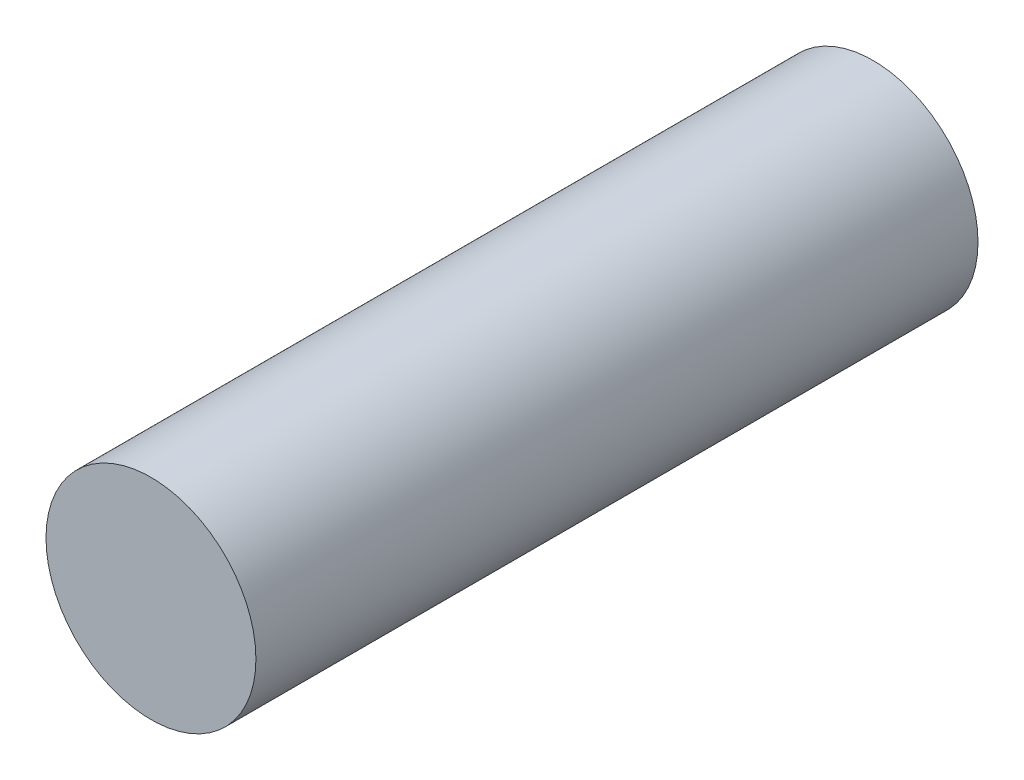
ISO-10303-21;
HEADER;
FILE_DESCRIPTION(('STEP AP214'),'2;1');
FILE_NAME('part.step','',(''),(''),'','','');
FILE_SCHEMA(('AUTOMOTIVE_DESIGN { 1 0 10303 214 1 1 1 1 }'));
ENDSEC;
DATA;
#1=APPLICATION_CONTEXT('core data for automotive mechanical design processes');
#2=APPLICATION_PROTOCOL_DEFINITION('international standard','automotive_design',2000,#1);
#3=PRODUCT_CONTEXT('',#1,'mechanical');
#4=PRODUCT('Part','Part','',(#3));
#5=PRODUCT_RELATED_PRODUCT_CATEGORY('part','',(#4));
#6=PRODUCT_DEFINITION_FORMATION('','',#4);
#7=PRODUCT_DEFINITION_CONTEXT('part definition',#1,'design');
#8=PRODUCT_DEFINITION('design','',#6,#7);
#9=PRODUCT_DEFINITION_SHAPE('','',#8);
#10=(LENGTH_UNIT() NAMED_UNIT(*) SI_UNIT(.MILLI.,.METRE.));
#11=(NAMED_UNIT(*) PLANE_ANGLE_UNIT() SI_UNIT($,.RADIAN.));
#12=(NAMED_UNIT(*) SI_UNIT($,.STERADIAN.) SOLID_ANGLE_UNIT());
#13=UNCERTAINTY_MEASURE_WITH_UNIT(LENGTH_MEASURE(1.E-05),#10,'distance_accuracy_value','');
#14=(GEOMETRIC_REPRESENTATION_CONTEXT(3) GLOBAL_UNCERTAINTY_ASSIGNED_CONTEXT((#13)) GLOBAL_UNIT_ASSIGNED_CONTEXT((#10,
#11,#12)) REPRESENTATION_CONTEXT('',''));
#15=CARTESIAN_POINT('',(0.,0.,0.));
#16=DIRECTION('',(0.,0.,1.));
#17=DIRECTION('',(1.,0.,0.));
#18=AXIS2_PLACEMENT_3D('',#15,#16,#17);
#19=CARTESIAN_POINT('',(0.,0.,-16.256));
#20=DIRECTION('',(0.,0.,-1.));
#21=DIRECTION('',(-1.,0.,0.));
#22=AXIS2_PLACEMENT_3D('',#19,#20,#21);
#23=PLANE('',#22);
#24=CARTESIAN_POINT('',(0.,0.,-16.256));
#25=DIRECTION('',(0.,0.,-1.));
#26=DIRECTION('',(-1.,0.,0.));
#27=AXIS2_PLACEMENT_3D('',#24,#25,#26);
#28=CIRCLE('',#27,4.7625);
#29=CARTESIAN_POINT('',(-4.7625,0.,-16.256));
#30=VERTEX_POINT('',#29);
#31=EDGE_CURVE('E17',#30,#30,#28,.T.);
#32=ORIENTED_EDGE('',*,*,#31,.T.);
#33=EDGE_LOOP('',(#32));
#34=FACE_BOUND('',#33,.T.);
#35=ADVANCED_FACE('F14',(#34),#23,.T.);
#36=CARTESIAN_POINT('',(0.,0.,16.51));
#37=DIRECTION('',(0.,0.,-1.));
#38=DIRECTION('',(-1.,0.,0.));
#39=AXIS2_PLACEMENT_3D('',#36,#37,#38);
#40=PLANE('',#39);
#41=CARTESIAN_POINT('',(0.,0.,16.51));
#42=DIRECTION('',(0.,0.,-1.));
#43=DIRECTION('',(-1.,0.,0.));
#44=AXIS2_PLACEMENT_3D('',#41,#42,#43);
#45=CIRCLE('',#44,4.7625);
#46=CARTESIAN_POINT('',(-4.7625,0.,16.51));
#47=VERTEX_POINT('',#46);
#48=EDGE_CURVE('E10',#47,#47,#45,.T.);
#49=ORIENTED_EDGE('',*,*,#48,.F.);
#50=EDGE_LOOP('',(#49));
#51=FACE_BOUND('',#50,.T.);
#52=ADVANCED_FACE('F29',(#51),#40,.F.);
#53=CARTESIAN_POINT('',(0.,0.,18.796));
#54=DIRECTION('',(0.,0.,-1.));
#55=DIRECTION('',(-1.,0.,0.));
#56=AXIS2_PLACEMENT_3D('',#53,#54,#55);
#57=CYLINDRICAL_SURFACE('',#56,4.7625);
#58=ORIENTED_EDGE('',*,*,#31,.F.);
#59=EDGE_LOOP('',(#58));
#60=FACE_BOUND('',#59,.T.);
#61=ORIENTED_EDGE('',*,*,#48,.T.);
#62=EDGE_LOOP('',(#61));
#63=FACE_BOUND('',#62,.T.);
#64=ADVANCED_FACE('F27',(#60,#63),#57,.T.);
#65=CLOSED_SHELL('',(#35,#52,#64));
#66=MANIFOLD_SOLID_BREP('B1',#65);
#67=ADVANCED_BREP_SHAPE_REPRESENTATION('',(#18,#66),#14);
#68=SHAPE_DEFINITION_REPRESENTATION(#9,#67);
ENDSEC;
END-ISO-10303-21;
